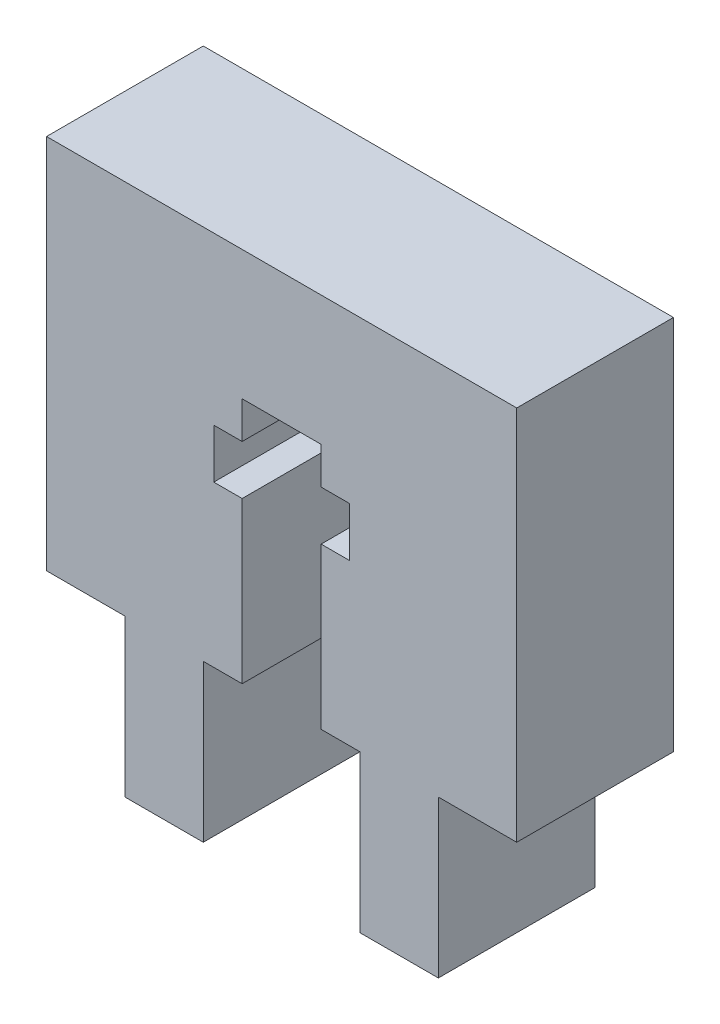
ISO-10303-21;
HEADER;
FILE_DESCRIPTION(('STEP AP214'),'2;1');
FILE_NAME('part.step','',(''),(''),'','','');
FILE_SCHEMA(('AUTOMOTIVE_DESIGN { 1 0 10303 214 1 1 1 1 }'));
ENDSEC;
DATA;
#1=APPLICATION_CONTEXT('core data for automotive mechanical design processes');
#2=APPLICATION_PROTOCOL_DEFINITION('international standard','automotive_design',2000,#1);
#3=PRODUCT_CONTEXT('',#1,'mechanical');
#4=PRODUCT('Part','Part','',(#3));
#5=PRODUCT_RELATED_PRODUCT_CATEGORY('part','',(#4));
#6=PRODUCT_DEFINITION_FORMATION('','',#4);
#7=PRODUCT_DEFINITION_CONTEXT('part definition',#1,'design');
#8=PRODUCT_DEFINITION('design','',#6,#7);
#9=PRODUCT_DEFINITION_SHAPE('','',#8);
#10=(LENGTH_UNIT() NAMED_UNIT(*) SI_UNIT(.MILLI.,.METRE.));
#11=(NAMED_UNIT(*) PLANE_ANGLE_UNIT() SI_UNIT($,.RADIAN.));
#12=(NAMED_UNIT(*) SI_UNIT($,.STERADIAN.) SOLID_ANGLE_UNIT());
#13=UNCERTAINTY_MEASURE_WITH_UNIT(LENGTH_MEASURE(1.E-05),#10,'distance_accuracy_value','');
#14=(GEOMETRIC_REPRESENTATION_CONTEXT(3) GLOBAL_UNCERTAINTY_ASSIGNED_CONTEXT((#13)) GLOBAL_UNIT_ASSIGNED_CONTEXT((#10,
#11,#12)) REPRESENTATION_CONTEXT('',''));
#15=CARTESIAN_POINT('',(0.,0.,0.));
#16=DIRECTION('',(0.,0.,1.));
#17=DIRECTION('',(1.,0.,0.));
#18=AXIS2_PLACEMENT_3D('',#15,#16,#17);
#19=CARTESIAN_POINT('',(3.175,0.,6.35));
#20=DIRECTION('',(0.,1.,0.));
#21=DIRECTION('',(-1.,0.,0.));
#22=AXIS2_PLACEMENT_3D('',#19,#20,#21);
#23=PLANE('',#22);
#24=DIRECTION('',(1.,0.,0.));
#25=VECTOR('',#24,1.);
#26=CARTESIAN_POINT('',(3.175,0.,0.));
#27=LINE('',#26,#25);
#28=CARTESIAN_POINT('',(3.175,0.,0.));
#29=VERTEX_POINT('',#28);
#30=CARTESIAN_POINT('',(4.75,0.,0.));
#31=VERTEX_POINT('',#30);
#32=EDGE_CURVE('E180',#29,#31,#27,.T.);
#33=ORIENTED_EDGE('',*,*,#32,.T.);
#34=DIRECTION('',(0.,0.,1.));
#35=VECTOR('',#34,1.);
#36=CARTESIAN_POINT('',(4.75,0.,0.));
#37=LINE('',#36,#35);
#38=CARTESIAN_POINT('',(4.75,0.,6.35));
#39=VERTEX_POINT('',#38);
#40=EDGE_CURVE('E242',#31,#39,#37,.T.);
#41=ORIENTED_EDGE('',*,*,#40,.T.);
#42=DIRECTION('',(1.,0.,0.));
#43=VECTOR('',#42,1.);
#44=CARTESIAN_POINT('',(3.175,0.,6.35));
#45=LINE('',#44,#43);
#46=CARTESIAN_POINT('',(3.175,0.,6.35));
#47=VERTEX_POINT('',#46);
#48=EDGE_CURVE('E239',#47,#39,#45,.T.);
#49=ORIENTED_EDGE('',*,*,#48,.F.);
#50=DIRECTION('',(0.,0.,-1.));
#51=VECTOR('',#50,1.);
#52=CARTESIAN_POINT('',(3.175,0.,6.35));
#53=LINE('',#52,#51);
#54=EDGE_CURVE('E211',#47,#29,#53,.T.);
#55=ORIENTED_EDGE('',*,*,#54,.T.);
#56=EDGE_LOOP('',(#33,#41,#49,#55));
#57=FACE_BOUND('',#56,.T.);
#58=ADVANCED_FACE('F35',(#57),#23,.F.);
#59=CARTESIAN_POINT('',(0.,0.,6.35));
#60=DIRECTION('',(0.,1.,0.));
#61=DIRECTION('',(-1.,0.,0.));
#62=AXIS2_PLACEMENT_3D('',#59,#60,#61);
#63=PLANE('',#62);
#64=DIRECTION('',(1.,0.,0.));
#65=VECTOR('',#64,1.);
#66=CARTESIAN_POINT('',(0.,0.,0.));
#67=LINE('',#66,#65);
#68=CARTESIAN_POINT('',(-3.175,0.,0.));
#69=VERTEX_POINT('',#68);
#70=CARTESIAN_POINT('',(0.,0.,0.));
#71=VERTEX_POINT('',#70);
#72=EDGE_CURVE('E169',#69,#71,#67,.T.);
#73=ORIENTED_EDGE('',*,*,#72,.T.);
#74=DIRECTION('',(0.,0.,-1.));
#75=VECTOR('',#74,1.);
#76=CARTESIAN_POINT('',(0.,0.,6.35));
#77=LINE('',#76,#75);
#78=CARTESIAN_POINT('',(0.,0.,6.35));
#79=VERTEX_POINT('',#78);
#80=EDGE_CURVE('E11',#79,#71,#77,.T.);
#81=ORIENTED_EDGE('',*,*,#80,.F.);
#82=DIRECTION('',(1.,0.,0.));
#83=VECTOR('',#82,1.);
#84=CARTESIAN_POINT('',(0.,0.,6.35));
#85=LINE('',#84,#83);
#86=CARTESIAN_POINT('',(-3.175,0.,6.35));
#87=VERTEX_POINT('',#86);
#88=EDGE_CURVE('E195',#87,#79,#85,.T.);
#89=ORIENTED_EDGE('',*,*,#88,.F.);
#90=DIRECTION('',(0.,0.,-1.));
#91=VECTOR('',#90,1.);
#92=CARTESIAN_POINT('',(-3.175,0.,6.35));
#93=LINE('',#92,#91);
#94=EDGE_CURVE('E165',#87,#69,#93,.T.);
#95=ORIENTED_EDGE('',*,*,#94,.T.);
#96=EDGE_LOOP('',(#73,#81,#89,#95));
#97=FACE_BOUND('',#96,.T.);
#98=ADVANCED_FACE('F37',(#97),#63,.F.);
#99=CARTESIAN_POINT('',(0.,0.,6.35));
#100=DIRECTION('',(1.,0.,0.));
#101=DIRECTION('',(0.,1.,0.));
#102=AXIS2_PLACEMENT_3D('',#99,#100,#101);
#103=PLANE('',#102);
#104=DIRECTION('',(0.,-1.,0.));
#105=VECTOR('',#104,1.);
#106=CARTESIAN_POINT('',(0.,0.,0.));
#107=LINE('',#106,#105);
#108=CARTESIAN_POINT('',(0.,-6.35,0.));
#109=VERTEX_POINT('',#108);
#110=EDGE_CURVE('E172',#71,#109,#107,.T.);
#111=ORIENTED_EDGE('',*,*,#110,.T.);
#112=DIRECTION('',(0.,0.,-1.));
#113=VECTOR('',#112,1.);
#114=CARTESIAN_POINT('',(0.,-6.35,6.35));
#115=LINE('',#114,#113);
#116=CARTESIAN_POINT('',(0.,-6.35,6.35));
#117=VERTEX_POINT('',#116);
#118=EDGE_CURVE('E43',#117,#109,#115,.T.);
#119=ORIENTED_EDGE('',*,*,#118,.F.);
#120=DIRECTION('',(0.,-1.,0.));
#121=VECTOR('',#120,1.);
#122=CARTESIAN_POINT('',(0.,0.,6.35));
#123=LINE('',#122,#121);
#124=EDGE_CURVE('E112',#79,#117,#123,.T.);
#125=ORIENTED_EDGE('',*,*,#124,.F.);
#126=ORIENTED_EDGE('',*,*,#80,.T.);
#127=EDGE_LOOP('',(#111,#119,#125,#126));
#128=FACE_BOUND('',#127,.T.);
#129=ADVANCED_FACE('F474',(#128),#103,.F.);
#130=CARTESIAN_POINT('',(0.,-6.35,6.35));
#131=DIRECTION('',(0.,1.,0.));
#132=DIRECTION('',(0.,0.,1.));
#133=AXIS2_PLACEMENT_3D('',#130,#131,#132);
#134=PLANE('',#133);
#135=DIRECTION('',(1.,0.,0.));
#136=VECTOR('',#135,1.);
#137=CARTESIAN_POINT('',(0.,-6.35,0.));
#138=LINE('',#137,#136);
#139=CARTESIAN_POINT('',(3.175,-6.35,0.));
#140=VERTEX_POINT('',#139);
#141=EDGE_CURVE('E175',#109,#140,#138,.T.);
#142=ORIENTED_EDGE('',*,*,#141,.T.);
#143=DIRECTION('',(0.,0.,-1.));
#144=VECTOR('',#143,1.);
#145=CARTESIAN_POINT('',(3.175,-6.35,6.35));
#146=LINE('',#145,#144);
#147=CARTESIAN_POINT('',(3.175,-6.35,6.35));
#148=VERTEX_POINT('',#147);
#149=EDGE_CURVE('E214',#148,#140,#146,.T.);
#150=ORIENTED_EDGE('',*,*,#149,.F.);
#151=DIRECTION('',(1.,0.,0.));
#152=VECTOR('',#151,1.);
#153=CARTESIAN_POINT('',(0.,-6.35,6.35));
#154=LINE('',#153,#152);
#155=EDGE_CURVE('E222',#117,#148,#154,.T.);
#156=ORIENTED_EDGE('',*,*,#155,.F.);
#157=ORIENTED_EDGE('',*,*,#118,.T.);
#158=EDGE_LOOP('',(#142,#150,#156,#157));
#159=FACE_BOUND('',#158,.T.);
#160=ADVANCED_FACE('F220',(#159),#134,.F.);
#161=CARTESIAN_POINT('',(3.175,0.,6.35));
#162=DIRECTION('',(-1.,0.,0.));
#163=DIRECTION('',(0.,-1.,0.));
#164=AXIS2_PLACEMENT_3D('',#161,#162,#163);
#165=PLANE('',#164);
#166=DIRECTION('',(0.,1.,0.));
#167=VECTOR('',#166,1.);
#168=CARTESIAN_POINT('',(3.175,0.,0.));
#169=LINE('',#168,#167);
#170=EDGE_CURVE('E177',#140,#29,#169,.T.);
#171=ORIENTED_EDGE('',*,*,#170,.T.);
#172=ORIENTED_EDGE('',*,*,#54,.F.);
#173=DIRECTION('',(0.,1.,0.));
#174=VECTOR('',#173,1.);
#175=CARTESIAN_POINT('',(3.175,0.,6.35));
#176=LINE('',#175,#174);
#177=EDGE_CURVE('E248',#148,#47,#176,.T.);
#178=ORIENTED_EDGE('',*,*,#177,.F.);
#179=ORIENTED_EDGE('',*,*,#149,.T.);
#180=EDGE_LOOP('',(#171,#172,#178,#179));
#181=FACE_BOUND('',#180,.T.);
#182=ADVANCED_FACE('F232',(#181),#165,.F.);
#183=CARTESIAN_POINT('',(7.95,0.,6.35));
#184=VERTEX_POINT('',#183);
#185=CARTESIAN_POINT('',(9.525,0.,6.35));
#186=VERTEX_POINT('',#185);
#187=EDGE_CURVE('E244',#184,#186,#45,.T.);
#188=ORIENTED_EDGE('',*,*,#187,.F.);
#189=DIRECTION('',(0.,0.,1.));
#190=VECTOR('',#189,1.);
#191=CARTESIAN_POINT('',(7.95,0.,0.));
#192=LINE('',#191,#190);
#193=CARTESIAN_POINT('',(7.95,0.,0.));
#194=VERTEX_POINT('',#193);
#195=EDGE_CURVE('E272',#194,#184,#192,.T.);
#196=ORIENTED_EDGE('',*,*,#195,.F.);
#197=CARTESIAN_POINT('',(9.525,0.,0.));
#198=VERTEX_POINT('',#197);
#199=EDGE_CURVE('E179',#194,#198,#27,.T.);
#200=ORIENTED_EDGE('',*,*,#199,.T.);
#201=DIRECTION('',(0.,0.,-1.));
#202=VECTOR('',#201,1.);
#203=CARTESIAN_POINT('',(9.525,0.,6.35));
#204=LINE('',#203,#202);
#205=EDGE_CURVE('E208',#186,#198,#204,.T.);
#206=ORIENTED_EDGE('',*,*,#205,.F.);
#207=EDGE_LOOP('',(#188,#196,#200,#206));
#208=FACE_BOUND('',#207,.T.);
#209=ADVANCED_FACE('F450',(#208),#23,.F.);
#210=CARTESIAN_POINT('',(9.525,0.,6.35));
#211=DIRECTION('',(1.,0.,0.));
#212=DIRECTION('',(0.,1.,0.));
#213=AXIS2_PLACEMENT_3D('',#210,#211,#212);
#214=PLANE('',#213);
#215=DIRECTION('',(0.,-1.,0.));
#216=VECTOR('',#215,1.);
#217=CARTESIAN_POINT('',(9.525,0.,0.));
#218=LINE('',#217,#216);
#219=CARTESIAN_POINT('',(9.525,-6.35,0.));
#220=VERTEX_POINT('',#219);
#221=EDGE_CURVE('E183',#198,#220,#218,.T.);
#222=ORIENTED_EDGE('',*,*,#221,.T.);
#223=DIRECTION('',(0.,0.,-1.));
#224=VECTOR('',#223,1.);
#225=CARTESIAN_POINT('',(9.525,-6.35,6.35));
#226=LINE('',#225,#224);
#227=CARTESIAN_POINT('',(9.525,-6.35,6.35));
#228=VERTEX_POINT('',#227);
#229=EDGE_CURVE('E205',#228,#220,#226,.T.);
#230=ORIENTED_EDGE('',*,*,#229,.F.);
#231=DIRECTION('',(0.,-1.,0.));
#232=VECTOR('',#231,1.);
#233=CARTESIAN_POINT('',(9.525,0.,6.35));
#234=LINE('',#233,#232);
#235=EDGE_CURVE('E243',#186,#228,#234,.T.);
#236=ORIENTED_EDGE('',*,*,#235,.F.);
#237=ORIENTED_EDGE('',*,*,#205,.T.);
#238=EDGE_LOOP('',(#222,#230,#236,#237));
#239=FACE_BOUND('',#238,.T.);
#240=ADVANCED_FACE('F457',(#239),#214,.F.);
#241=CARTESIAN_POINT('',(12.7,-6.35,6.35));
#242=DIRECTION('',(0.,1.,0.));
#243=DIRECTION('',(-1.,0.,0.));
#244=AXIS2_PLACEMENT_3D('',#241,#242,#243);
#245=PLANE('',#244);
#246=DIRECTION('',(1.,0.,0.));
#247=VECTOR('',#246,1.);
#248=CARTESIAN_POINT('',(12.7,-6.35,0.));
#249=LINE('',#248,#247);
#250=CARTESIAN_POINT('',(12.7,-6.35,0.));
#251=VERTEX_POINT('',#250);
#252=EDGE_CURVE('E185',#220,#251,#249,.T.);
#253=ORIENTED_EDGE('',*,*,#252,.T.);
#254=DIRECTION('',(0.,0.,-1.));
#255=VECTOR('',#254,1.);
#256=CARTESIAN_POINT('',(12.7,-6.35,6.35));
#257=LINE('',#256,#255);
#258=CARTESIAN_POINT('',(12.7,-6.35,6.35));
#259=VERTEX_POINT('',#258);
#260=EDGE_CURVE('E202',#259,#251,#257,.T.);
#261=ORIENTED_EDGE('',*,*,#260,.F.);
#262=DIRECTION('',(1.,0.,0.));
#263=VECTOR('',#262,1.);
#264=CARTESIAN_POINT('',(12.7,-6.35,6.35));
#265=LINE('',#264,#263);
#266=EDGE_CURVE('E246',#228,#259,#265,.T.);
#267=ORIENTED_EDGE('',*,*,#266,.F.);
#268=ORIENTED_EDGE('',*,*,#229,.T.);
#269=EDGE_LOOP('',(#253,#261,#267,#268));
#270=FACE_BOUND('',#269,.T.);
#271=ADVANCED_FACE('F460',(#270),#245,.F.);
#272=CARTESIAN_POINT('',(12.7,0.,6.35));
#273=DIRECTION('',(-1.,0.,0.));
#274=DIRECTION('',(0.,0.,1.));
#275=AXIS2_PLACEMENT_3D('',#272,#273,#274);
#276=PLANE('',#275);
#277=DIRECTION('',(0.,1.,0.));
#278=VECTOR('',#277,1.);
#279=CARTESIAN_POINT('',(12.7,0.,0.));
#280=LINE('',#279,#278);
#281=CARTESIAN_POINT('',(12.7,0.,0.));
#282=VERTEX_POINT('',#281);
#283=EDGE_CURVE('E187',#251,#282,#280,.T.);
#284=ORIENTED_EDGE('',*,*,#283,.T.);
#285=DIRECTION('',(0.,0.,-1.));
#286=VECTOR('',#285,1.);
#287=CARTESIAN_POINT('',(12.7,0.,6.35));
#288=LINE('',#287,#286);
#289=CARTESIAN_POINT('',(12.7,0.,6.35));
#290=VERTEX_POINT('',#289);
#291=EDGE_CURVE('E199',#290,#282,#288,.T.);
#292=ORIENTED_EDGE('',*,*,#291,.F.);
#293=DIRECTION('',(0.,1.,0.));
#294=VECTOR('',#293,1.);
#295=CARTESIAN_POINT('',(12.7,0.,6.35));
#296=LINE('',#295,#294);
#297=EDGE_CURVE('E253',#259,#290,#296,.T.);
#298=ORIENTED_EDGE('',*,*,#297,.F.);
#299=ORIENTED_EDGE('',*,*,#260,.T.);
#300=EDGE_LOOP('',(#284,#292,#298,#299));
#301=FACE_BOUND('',#300,.T.);
#302=ADVANCED_FACE('F259',(#301),#276,.F.);
#303=CARTESIAN_POINT('',(12.7,0.,6.35));
#304=DIRECTION('',(0.,1.,0.));
#305=DIRECTION('',(-1.,0.,0.));
#306=AXIS2_PLACEMENT_3D('',#303,#304,#305);
#307=PLANE('',#306);
#308=DIRECTION('',(1.,0.,0.));
#309=VECTOR('',#308,1.);
#310=CARTESIAN_POINT('',(12.7,0.,0.));
#311=LINE('',#310,#309);
#312=CARTESIAN_POINT('',(15.875,0.,0.));
#313=VERTEX_POINT('',#312);
#314=EDGE_CURVE('E189',#282,#313,#311,.T.);
#315=ORIENTED_EDGE('',*,*,#314,.T.);
#316=DIRECTION('',(0.,0.,-1.));
#317=VECTOR('',#316,1.);
#318=CARTESIAN_POINT('',(15.875,0.,6.35));
#319=LINE('',#318,#317);
#320=CARTESIAN_POINT('',(15.875,0.,6.35));
#321=VERTEX_POINT('',#320);
#322=EDGE_CURVE('E160',#321,#313,#319,.T.);
#323=ORIENTED_EDGE('',*,*,#322,.F.);
#324=DIRECTION('',(1.,0.,0.));
#325=VECTOR('',#324,1.);
#326=CARTESIAN_POINT('',(12.7,0.,6.35));
#327=LINE('',#326,#325);
#328=EDGE_CURVE('E148',#290,#321,#327,.T.);
#329=ORIENTED_EDGE('',*,*,#328,.F.);
#330=ORIENTED_EDGE('',*,*,#291,.T.);
#331=EDGE_LOOP('',(#315,#323,#329,#330));
#332=FACE_BOUND('',#331,.T.);
#333=ADVANCED_FACE('F263',(#332),#307,.F.);
#334=CARTESIAN_POINT('',(15.875,15.24,6.35));
#335=DIRECTION('',(-1.,0.,0.));
#336=DIRECTION('',(0.,0.,1.));
#337=AXIS2_PLACEMENT_3D('',#334,#335,#336);
#338=PLANE('',#337);
#339=DIRECTION('',(0.,1.,0.));
#340=VECTOR('',#339,1.);
#341=CARTESIAN_POINT('',(15.875,15.24,0.));
#342=LINE('',#341,#340);
#343=CARTESIAN_POINT('',(15.875,15.24,0.));
#344=VERTEX_POINT('',#343);
#345=EDGE_CURVE('E157',#313,#344,#342,.T.);
#346=ORIENTED_EDGE('',*,*,#345,.T.);
#347=DIRECTION('',(0.,0.,-1.));
#348=VECTOR('',#347,1.);
#349=CARTESIAN_POINT('',(15.875,15.24,6.35));
#350=LINE('',#349,#348);
#351=CARTESIAN_POINT('',(15.875,15.24,6.35));
#352=VERTEX_POINT('',#351);
#353=EDGE_CURVE('E154',#352,#344,#350,.T.);
#354=ORIENTED_EDGE('',*,*,#353,.F.);
#355=DIRECTION('',(0.,1.,0.));
#356=VECTOR('',#355,1.);
#357=CARTESIAN_POINT('',(15.875,15.24,6.35));
#358=LINE('',#357,#356);
#359=EDGE_CURVE('E140',#321,#352,#358,.T.);
#360=ORIENTED_EDGE('',*,*,#359,.F.);
#361=ORIENTED_EDGE('',*,*,#322,.T.);
#362=EDGE_LOOP('',(#346,#354,#360,#361));
#363=FACE_BOUND('',#362,.T.);
#364=ADVANCED_FACE('F155',(#363),#338,.F.);
#365=CARTESIAN_POINT('',(-3.175,15.24,6.35));
#366=DIRECTION('',(0.,-1.,0.));
#367=DIRECTION('',(0.,0.,-1.));
#368=AXIS2_PLACEMENT_3D('',#365,#366,#367);
#369=PLANE('',#368);
#370=DIRECTION('',(-1.,0.,0.));
#371=VECTOR('',#370,1.);
#372=CARTESIAN_POINT('',(-3.175,15.24,0.));
#373=LINE('',#372,#371);
#374=CARTESIAN_POINT('',(-3.175,15.24,0.));
#375=VERTEX_POINT('',#374);
#376=EDGE_CURVE('E192',#344,#375,#373,.T.);
#377=ORIENTED_EDGE('',*,*,#376,.T.);
#378=DIRECTION('',(0.,0.,-1.));
#379=VECTOR('',#378,1.);
#380=CARTESIAN_POINT('',(-3.175,15.24,6.35));
#381=LINE('',#380,#379);
#382=CARTESIAN_POINT('',(-3.175,15.24,6.35));
#383=VERTEX_POINT('',#382);
#384=EDGE_CURVE('E161',#383,#375,#381,.T.);
#385=ORIENTED_EDGE('',*,*,#384,.F.);
#386=DIRECTION('',(-1.,0.,0.));
#387=VECTOR('',#386,1.);
#388=CARTESIAN_POINT('',(-3.175,15.24,6.35));
#389=LINE('',#388,#387);
#390=EDGE_CURVE('E145',#352,#383,#389,.T.);
#391=ORIENTED_EDGE('',*,*,#390,.F.);
#392=ORIENTED_EDGE('',*,*,#353,.T.);
#393=EDGE_LOOP('',(#377,#385,#391,#392));
#394=FACE_BOUND('',#393,.T.);
#395=ADVANCED_FACE('F163',(#394),#369,.F.);
#396=CARTESIAN_POINT('',(-3.175,15.24,6.35));
#397=DIRECTION('',(1.,0.,0.));
#398=DIRECTION('',(0.,1.,0.));
#399=AXIS2_PLACEMENT_3D('',#396,#397,#398);
#400=PLANE('',#399);
#401=DIRECTION('',(0.,-1.,0.));
#402=VECTOR('',#401,1.);
#403=CARTESIAN_POINT('',(-3.175,15.24,0.));
#404=LINE('',#403,#402);
#405=EDGE_CURVE('E104',#375,#69,#404,.T.);
#406=ORIENTED_EDGE('',*,*,#405,.T.);
#407=ORIENTED_EDGE('',*,*,#94,.F.);
#408=DIRECTION('',(0.,-1.,0.));
#409=VECTOR('',#408,1.);
#410=CARTESIAN_POINT('',(-3.175,15.24,6.35));
#411=LINE('',#410,#409);
#412=EDGE_CURVE('E59',#383,#87,#411,.T.);
#413=ORIENTED_EDGE('',*,*,#412,.F.);
#414=ORIENTED_EDGE('',*,*,#384,.T.);
#415=EDGE_LOOP('',(#406,#407,#413,#414));
#416=FACE_BOUND('',#415,.T.);
#417=ADVANCED_FACE('F264',(#416),#400,.F.);
#418=CARTESIAN_POINT('',(0.,0.,6.35));
#419=DIRECTION('',(0.,0.,1.));
#420=DIRECTION('',(1.,0.,0.));
#421=AXIS2_PLACEMENT_3D('',#418,#419,#420);
#422=PLANE('',#421);
#423=DIRECTION('',(0.,-1.,0.));
#424=VECTOR('',#423,1.);
#425=CARTESIAN_POINT('',(4.75,0.,6.35));
#426=LINE('',#425,#424);
#427=CARTESIAN_POINT('',(4.75,6.5,6.35));
#428=VERTEX_POINT('',#427);
#429=EDGE_CURVE('E335',#428,#39,#426,.T.);
#430=ORIENTED_EDGE('',*,*,#429,.F.);
#431=DIRECTION('',(1.,0.,0.));
#432=VECTOR('',#431,1.);
#433=CARTESIAN_POINT('',(4.75,6.5,6.35));
#434=LINE('',#433,#432);
#435=CARTESIAN_POINT('',(3.6,6.5,6.35));
#436=VERTEX_POINT('',#435);
#437=EDGE_CURVE('E304',#436,#428,#434,.T.);
#438=ORIENTED_EDGE('',*,*,#437,.F.);
#439=DIRECTION('',(0.,-1.,0.));
#440=VECTOR('',#439,1.);
#441=CARTESIAN_POINT('',(3.6,8.5,6.35));
#442=LINE('',#441,#440);
#443=CARTESIAN_POINT('',(3.6,8.5,6.35));
#444=VERTEX_POINT('',#443);
#445=EDGE_CURVE('E308',#444,#436,#442,.T.);
#446=ORIENTED_EDGE('',*,*,#445,.F.);
#447=DIRECTION('',(-1.,0.,0.));
#448=VECTOR('',#447,1.);
#449=CARTESIAN_POINT('',(4.75,8.5,6.35));
#450=LINE('',#449,#448);
#451=CARTESIAN_POINT('',(4.75,8.5,6.35));
#452=VERTEX_POINT('',#451);
#453=EDGE_CURVE('E311',#452,#444,#450,.T.);
#454=ORIENTED_EDGE('',*,*,#453,.F.);
#455=DIRECTION('',(0.,-1.,0.));
#456=VECTOR('',#455,1.);
#457=CARTESIAN_POINT('',(4.75,8.5,6.35));
#458=LINE('',#457,#456);
#459=CARTESIAN_POINT('',(4.75,10.,6.35));
#460=VERTEX_POINT('',#459);
#461=EDGE_CURVE('E314',#460,#452,#458,.T.);
#462=ORIENTED_EDGE('',*,*,#461,.F.);
#463=DIRECTION('',(-1.,0.,0.));
#464=VECTOR('',#463,1.);
#465=CARTESIAN_POINT('',(4.75,10.,6.35));
#466=LINE('',#465,#464);
#467=CARTESIAN_POINT('',(7.95,10.,6.35));
#468=VERTEX_POINT('',#467);
#469=EDGE_CURVE('E317',#468,#460,#466,.T.);
#470=ORIENTED_EDGE('',*,*,#469,.F.);
#471=DIRECTION('',(0.,1.,0.));
#472=VECTOR('',#471,1.);
#473=CARTESIAN_POINT('',(7.95,8.5,6.35));
#474=LINE('',#473,#472);
#475=CARTESIAN_POINT('',(7.95,8.5,6.35));
#476=VERTEX_POINT('',#475);
#477=EDGE_CURVE('E320',#476,#468,#474,.T.);
#478=ORIENTED_EDGE('',*,*,#477,.F.);
#479=DIRECTION('',(-1.,0.,0.));
#480=VECTOR('',#479,1.);
#481=CARTESIAN_POINT('',(7.95,8.5,6.35));
#482=LINE('',#481,#480);
#483=CARTESIAN_POINT('',(9.1,8.5,6.35));
#484=VERTEX_POINT('',#483);
#485=EDGE_CURVE('E323',#484,#476,#482,.T.);
#486=ORIENTED_EDGE('',*,*,#485,.F.);
#487=DIRECTION('',(0.,1.,0.));
#488=VECTOR('',#487,1.);
#489=CARTESIAN_POINT('',(9.1,8.5,6.35));
#490=LINE('',#489,#488);
#491=CARTESIAN_POINT('',(9.1,6.5,6.35));
#492=VERTEX_POINT('',#491);
#493=EDGE_CURVE('E326',#492,#484,#490,.T.);
#494=ORIENTED_EDGE('',*,*,#493,.F.);
#495=DIRECTION('',(1.,0.,0.));
#496=VECTOR('',#495,1.);
#497=CARTESIAN_POINT('',(7.95,6.5,6.35));
#498=LINE('',#497,#496);
#499=CARTESIAN_POINT('',(7.95,6.5,6.35));
#500=VERTEX_POINT('',#499);
#501=EDGE_CURVE('E329',#500,#492,#498,.T.);
#502=ORIENTED_EDGE('',*,*,#501,.F.);
#503=DIRECTION('',(0.,1.,0.));
#504=VECTOR('',#503,1.);
#505=CARTESIAN_POINT('',(7.95,0.,6.35));
#506=LINE('',#505,#504);
#507=EDGE_CURVE('E332',#184,#500,#506,.T.);
#508=ORIENTED_EDGE('',*,*,#507,.F.);
#509=ORIENTED_EDGE('',*,*,#187,.T.);
#510=ORIENTED_EDGE('',*,*,#235,.T.);
#511=ORIENTED_EDGE('',*,*,#266,.T.);
#512=ORIENTED_EDGE('',*,*,#297,.T.);
#513=ORIENTED_EDGE('',*,*,#328,.T.);
#514=ORIENTED_EDGE('',*,*,#359,.T.);
#515=ORIENTED_EDGE('',*,*,#390,.T.);
#516=ORIENTED_EDGE('',*,*,#412,.T.);
#517=ORIENTED_EDGE('',*,*,#88,.T.);
#518=ORIENTED_EDGE('',*,*,#124,.T.);
#519=ORIENTED_EDGE('',*,*,#155,.T.);
#520=ORIENTED_EDGE('',*,*,#177,.T.);
#521=ORIENTED_EDGE('',*,*,#48,.T.);
#522=EDGE_LOOP('',(#430,#438,#446,#454,#462,#470,#478,#486,#494,#502,#508,#509,#510,#511,#512,
#513,#514,#515,#516,#517,#518,#519,#520,#521));
#523=FACE_BOUND('',#522,.T.);
#524=ADVANCED_FACE('F143',(#523),#422,.T.);
#525=CARTESIAN_POINT('',(0.,0.,0.));
#526=DIRECTION('',(0.,0.,1.));
#527=DIRECTION('',(1.,0.,0.));
#528=AXIS2_PLACEMENT_3D('',#525,#526,#527);
#529=PLANE('',#528);
#530=DIRECTION('',(1.,0.,0.));
#531=VECTOR('',#530,1.);
#532=CARTESIAN_POINT('',(4.75,6.5,0.));
#533=LINE('',#532,#531);
#534=CARTESIAN_POINT('',(3.6,6.5,0.));
#535=VERTEX_POINT('',#534);
#536=CARTESIAN_POINT('',(4.75,6.5,0.));
#537=VERTEX_POINT('',#536);
#538=EDGE_CURVE('E273',#535,#537,#533,.T.);
#539=ORIENTED_EDGE('',*,*,#538,.T.);
#540=DIRECTION('',(0.,-1.,0.));
#541=VECTOR('',#540,1.);
#542=CARTESIAN_POINT('',(4.75,0.,0.));
#543=LINE('',#542,#541);
#544=EDGE_CURVE('E307',#537,#31,#543,.T.);
#545=ORIENTED_EDGE('',*,*,#544,.T.);
#546=ORIENTED_EDGE('',*,*,#32,.F.);
#547=ORIENTED_EDGE('',*,*,#170,.F.);
#548=ORIENTED_EDGE('',*,*,#141,.F.);
#549=ORIENTED_EDGE('',*,*,#110,.F.);
#550=ORIENTED_EDGE('',*,*,#72,.F.);
#551=ORIENTED_EDGE('',*,*,#405,.F.);
#552=ORIENTED_EDGE('',*,*,#376,.F.);
#553=ORIENTED_EDGE('',*,*,#345,.F.);
#554=ORIENTED_EDGE('',*,*,#314,.F.);
#555=ORIENTED_EDGE('',*,*,#283,.F.);
#556=ORIENTED_EDGE('',*,*,#252,.F.);
#557=ORIENTED_EDGE('',*,*,#221,.F.);
#558=ORIENTED_EDGE('',*,*,#199,.F.);
#559=DIRECTION('',(0.,1.,0.));
#560=VECTOR('',#559,1.);
#561=CARTESIAN_POINT('',(7.95,0.,0.));
#562=LINE('',#561,#560);
#563=CARTESIAN_POINT('',(7.95,6.5,0.));
#564=VERTEX_POINT('',#563);
#565=EDGE_CURVE('E361',#194,#564,#562,.T.);
#566=ORIENTED_EDGE('',*,*,#565,.T.);
#567=DIRECTION('',(1.,0.,0.));
#568=VECTOR('',#567,1.);
#569=CARTESIAN_POINT('',(7.95,6.5,0.));
#570=LINE('',#569,#568);
#571=CARTESIAN_POINT('',(9.1,6.5,0.));
#572=VERTEX_POINT('',#571);
#573=EDGE_CURVE('E50',#564,#572,#570,.T.);
#574=ORIENTED_EDGE('',*,*,#573,.T.);
#575=DIRECTION('',(0.,1.,0.));
#576=VECTOR('',#575,1.);
#577=CARTESIAN_POINT('',(9.1,8.5,0.));
#578=LINE('',#577,#576);
#579=CARTESIAN_POINT('',(9.1,8.5,0.));
#580=VERTEX_POINT('',#579);
#581=EDGE_CURVE('E357',#572,#580,#578,.T.);
#582=ORIENTED_EDGE('',*,*,#581,.T.);
#583=DIRECTION('',(-1.,0.,0.));
#584=VECTOR('',#583,1.);
#585=CARTESIAN_POINT('',(7.95,8.5,0.));
#586=LINE('',#585,#584);
#587=CARTESIAN_POINT('',(7.95,8.5,0.));
#588=VERTEX_POINT('',#587);
#589=EDGE_CURVE('E354',#580,#588,#586,.T.);
#590=ORIENTED_EDGE('',*,*,#589,.T.);
#591=DIRECTION('',(0.,1.,0.));
#592=VECTOR('',#591,1.);
#593=CARTESIAN_POINT('',(7.95,8.5,0.));
#594=LINE('',#593,#592);
#595=CARTESIAN_POINT('',(7.95,10.,0.));
#596=VERTEX_POINT('',#595);
#597=EDGE_CURVE('E351',#588,#596,#594,.T.);
#598=ORIENTED_EDGE('',*,*,#597,.T.);
#599=DIRECTION('',(-1.,0.,0.));
#600=VECTOR('',#599,1.);
#601=CARTESIAN_POINT('',(4.75,10.,0.));
#602=LINE('',#601,#600);
#603=CARTESIAN_POINT('',(4.75,10.,0.));
#604=VERTEX_POINT('',#603);
#605=EDGE_CURVE('E348',#596,#604,#602,.T.);
#606=ORIENTED_EDGE('',*,*,#605,.T.);
#607=DIRECTION('',(0.,-1.,0.));
#608=VECTOR('',#607,1.);
#609=CARTESIAN_POINT('',(4.75,8.5,0.));
#610=LINE('',#609,#608);
#611=CARTESIAN_POINT('',(4.75,8.5,0.));
#612=VERTEX_POINT('',#611);
#613=EDGE_CURVE('E345',#604,#612,#610,.T.);
#614=ORIENTED_EDGE('',*,*,#613,.T.);
#615=DIRECTION('',(-1.,0.,0.));
#616=VECTOR('',#615,1.);
#617=CARTESIAN_POINT('',(4.75,8.5,0.));
#618=LINE('',#617,#616);
#619=CARTESIAN_POINT('',(3.6,8.5,0.));
#620=VERTEX_POINT('',#619);
#621=EDGE_CURVE('E342',#612,#620,#618,.T.);
#622=ORIENTED_EDGE('',*,*,#621,.T.);
#623=DIRECTION('',(0.,-1.,0.));
#624=VECTOR('',#623,1.);
#625=CARTESIAN_POINT('',(3.6,8.5,0.));
#626=LINE('',#625,#624);
#627=EDGE_CURVE('E339',#620,#535,#626,.T.);
#628=ORIENTED_EDGE('',*,*,#627,.T.);
#629=EDGE_LOOP('',(#539,#545,#546,#547,#548,#549,#550,#551,#552,#553,#554,#555,#556,#557,#558,
#566,#574,#582,#590,#598,#606,#614,#622,#628));
#630=FACE_BOUND('',#629,.T.);
#631=ADVANCED_FACE('F226',(#630),#529,.F.);
#632=CARTESIAN_POINT('',(4.75,0.,0.));
#633=DIRECTION('',(-1.,0.,0.));
#634=DIRECTION('',(0.,-1.,0.));
#635=AXIS2_PLACEMENT_3D('',#632,#633,#634);
#636=PLANE('',#635);
#637=ORIENTED_EDGE('',*,*,#429,.T.);
#638=ORIENTED_EDGE('',*,*,#40,.F.);
#639=ORIENTED_EDGE('',*,*,#544,.F.);
#640=DIRECTION('',(0.,0.,1.));
#641=VECTOR('',#640,1.);
#642=CARTESIAN_POINT('',(4.75,6.5,0.));
#643=LINE('',#642,#641);
#644=EDGE_CURVE('E173',#537,#428,#643,.T.);
#645=ORIENTED_EDGE('',*,*,#644,.T.);
#646=EDGE_LOOP('',(#637,#638,#639,#645));
#647=FACE_BOUND('',#646,.T.);
#648=ADVANCED_FACE('F369',(#647),#636,.F.);
#649=CARTESIAN_POINT('',(4.75,6.5,0.));
#650=DIRECTION('',(0.,-1.,0.));
#651=DIRECTION('',(1.,0.,0.));
#652=AXIS2_PLACEMENT_3D('',#649,#650,#651);
#653=PLANE('',#652);
#654=ORIENTED_EDGE('',*,*,#437,.T.);
#655=ORIENTED_EDGE('',*,*,#644,.F.);
#656=ORIENTED_EDGE('',*,*,#538,.F.);
#657=DIRECTION('',(0.,0.,1.));
#658=VECTOR('',#657,1.);
#659=CARTESIAN_POINT('',(3.6,6.5,0.));
#660=LINE('',#659,#658);
#661=EDGE_CURVE('E299',#535,#436,#660,.T.);
#662=ORIENTED_EDGE('',*,*,#661,.T.);
#663=EDGE_LOOP('',(#654,#655,#656,#662));
#664=FACE_BOUND('',#663,.T.);
#665=ADVANCED_FACE('F398',(#664),#653,.F.);
#666=CARTESIAN_POINT('',(3.6,8.5,0.));
#667=DIRECTION('',(-1.,0.,0.));
#668=DIRECTION('',(0.,0.,1.));
#669=AXIS2_PLACEMENT_3D('',#666,#667,#668);
#670=PLANE('',#669);
#671=ORIENTED_EDGE('',*,*,#445,.T.);
#672=ORIENTED_EDGE('',*,*,#661,.F.);
#673=ORIENTED_EDGE('',*,*,#627,.F.);
#674=DIRECTION('',(0.,0.,1.));
#675=VECTOR('',#674,1.);
#676=CARTESIAN_POINT('',(3.6,8.5,0.));
#677=LINE('',#676,#675);
#678=EDGE_CURVE('E296',#620,#444,#677,.T.);
#679=ORIENTED_EDGE('',*,*,#678,.T.);
#680=EDGE_LOOP('',(#671,#672,#673,#679));
#681=FACE_BOUND('',#680,.T.);
#682=ADVANCED_FACE('F403',(#681),#670,.F.);
#683=CARTESIAN_POINT('',(4.75,8.5,0.));
#684=DIRECTION('',(0.,1.,0.));
#685=DIRECTION('',(-1.,0.,0.));
#686=AXIS2_PLACEMENT_3D('',#683,#684,#685);
#687=PLANE('',#686);
#688=ORIENTED_EDGE('',*,*,#453,.T.);
#689=ORIENTED_EDGE('',*,*,#678,.F.);
#690=ORIENTED_EDGE('',*,*,#621,.F.);
#691=DIRECTION('',(0.,0.,1.));
#692=VECTOR('',#691,1.);
#693=CARTESIAN_POINT('',(4.75,8.5,0.));
#694=LINE('',#693,#692);
#695=EDGE_CURVE('E293',#612,#452,#694,.T.);
#696=ORIENTED_EDGE('',*,*,#695,.T.);
#697=EDGE_LOOP('',(#688,#689,#690,#696));
#698=FACE_BOUND('',#697,.T.);
#699=ADVANCED_FACE('F409',(#698),#687,.F.);
#700=CARTESIAN_POINT('',(4.75,8.5,0.));
#701=DIRECTION('',(-1.,0.,0.));
#702=DIRECTION('',(0.,0.,1.));
#703=AXIS2_PLACEMENT_3D('',#700,#701,#702);
#704=PLANE('',#703);
#705=ORIENTED_EDGE('',*,*,#461,.T.);
#706=ORIENTED_EDGE('',*,*,#695,.F.);
#707=ORIENTED_EDGE('',*,*,#613,.F.);
#708=DIRECTION('',(0.,0.,1.));
#709=VECTOR('',#708,1.);
#710=CARTESIAN_POINT('',(4.75,10.,0.));
#711=LINE('',#710,#709);
#712=EDGE_CURVE('E290',#604,#460,#711,.T.);
#713=ORIENTED_EDGE('',*,*,#712,.T.);
#714=EDGE_LOOP('',(#705,#706,#707,#713));
#715=FACE_BOUND('',#714,.T.);
#716=ADVANCED_FACE('F415',(#715),#704,.F.);
#717=CARTESIAN_POINT('',(4.75,10.,0.));
#718=DIRECTION('',(0.,1.,0.));
#719=DIRECTION('',(0.,0.,1.));
#720=AXIS2_PLACEMENT_3D('',#717,#718,#719);
#721=PLANE('',#720);
#722=ORIENTED_EDGE('',*,*,#469,.T.);
#723=ORIENTED_EDGE('',*,*,#712,.F.);
#724=ORIENTED_EDGE('',*,*,#605,.F.);
#725=DIRECTION('',(0.,0.,1.));
#726=VECTOR('',#725,1.);
#727=CARTESIAN_POINT('',(7.95,10.,0.));
#728=LINE('',#727,#726);
#729=EDGE_CURVE('E287',#596,#468,#728,.T.);
#730=ORIENTED_EDGE('',*,*,#729,.T.);
#731=EDGE_LOOP('',(#722,#723,#724,#730));
#732=FACE_BOUND('',#731,.T.);
#733=ADVANCED_FACE('F420',(#732),#721,.F.);
#734=CARTESIAN_POINT('',(7.95,8.5,0.));
#735=DIRECTION('',(1.,0.,0.));
#736=DIRECTION('',(0.,0.,-1.));
#737=AXIS2_PLACEMENT_3D('',#734,#735,#736);
#738=PLANE('',#737);
#739=ORIENTED_EDGE('',*,*,#477,.T.);
#740=ORIENTED_EDGE('',*,*,#729,.F.);
#741=ORIENTED_EDGE('',*,*,#597,.F.);
#742=DIRECTION('',(0.,0.,1.));
#743=VECTOR('',#742,1.);
#744=CARTESIAN_POINT('',(7.95,8.5,0.));
#745=LINE('',#744,#743);
#746=EDGE_CURVE('E284',#588,#476,#745,.T.);
#747=ORIENTED_EDGE('',*,*,#746,.T.);
#748=EDGE_LOOP('',(#739,#740,#741,#747));
#749=FACE_BOUND('',#748,.T.);
#750=ADVANCED_FACE('F426',(#749),#738,.F.);
#751=CARTESIAN_POINT('',(7.95,8.5,0.));
#752=DIRECTION('',(0.,1.,0.));
#753=DIRECTION('',(-1.,0.,0.));
#754=AXIS2_PLACEMENT_3D('',#751,#752,#753);
#755=PLANE('',#754);
#756=ORIENTED_EDGE('',*,*,#485,.T.);
#757=ORIENTED_EDGE('',*,*,#746,.F.);
#758=ORIENTED_EDGE('',*,*,#589,.F.);
#759=DIRECTION('',(0.,0.,1.));
#760=VECTOR('',#759,1.);
#761=CARTESIAN_POINT('',(9.1,8.5,0.));
#762=LINE('',#761,#760);
#763=EDGE_CURVE('E281',#580,#484,#762,.T.);
#764=ORIENTED_EDGE('',*,*,#763,.T.);
#765=EDGE_LOOP('',(#756,#757,#758,#764));
#766=FACE_BOUND('',#765,.T.);
#767=ADVANCED_FACE('F433',(#766),#755,.F.);
#768=CARTESIAN_POINT('',(9.1,8.5,0.));
#769=DIRECTION('',(1.,0.,0.));
#770=DIRECTION('',(0.,0.,-1.));
#771=AXIS2_PLACEMENT_3D('',#768,#769,#770);
#772=PLANE('',#771);
#773=ORIENTED_EDGE('',*,*,#493,.T.);
#774=ORIENTED_EDGE('',*,*,#763,.F.);
#775=ORIENTED_EDGE('',*,*,#581,.F.);
#776=DIRECTION('',(0.,0.,1.));
#777=VECTOR('',#776,1.);
#778=CARTESIAN_POINT('',(9.1,6.5,0.));
#779=LINE('',#778,#777);
#780=EDGE_CURVE('E278',#572,#492,#779,.T.);
#781=ORIENTED_EDGE('',*,*,#780,.T.);
#782=EDGE_LOOP('',(#773,#774,#775,#781));
#783=FACE_BOUND('',#782,.T.);
#784=ADVANCED_FACE('F438',(#783),#772,.F.);
#785=CARTESIAN_POINT('',(7.95,6.5,0.));
#786=DIRECTION('',(0.,-1.,0.));
#787=DIRECTION('',(1.,0.,0.));
#788=AXIS2_PLACEMENT_3D('',#785,#786,#787);
#789=PLANE('',#788);
#790=ORIENTED_EDGE('',*,*,#501,.T.);
#791=ORIENTED_EDGE('',*,*,#780,.F.);
#792=ORIENTED_EDGE('',*,*,#573,.F.);
#793=DIRECTION('',(0.,0.,1.));
#794=VECTOR('',#793,1.);
#795=CARTESIAN_POINT('',(7.95,6.5,0.));
#796=LINE('',#795,#794);
#797=EDGE_CURVE('E276',#564,#500,#796,.T.);
#798=ORIENTED_EDGE('',*,*,#797,.T.);
#799=EDGE_LOOP('',(#790,#791,#792,#798));
#800=FACE_BOUND('',#799,.T.);
#801=ADVANCED_FACE('F442',(#800),#789,.F.);
#802=CARTESIAN_POINT('',(7.95,0.,0.));
#803=DIRECTION('',(1.,0.,0.));
#804=DIRECTION('',(0.,0.,-1.));
#805=AXIS2_PLACEMENT_3D('',#802,#803,#804);
#806=PLANE('',#805);
#807=ORIENTED_EDGE('',*,*,#507,.T.);
#808=ORIENTED_EDGE('',*,*,#797,.F.);
#809=ORIENTED_EDGE('',*,*,#565,.F.);
#810=ORIENTED_EDGE('',*,*,#195,.T.);
#811=EDGE_LOOP('',(#807,#808,#809,#810));
#812=FACE_BOUND('',#811,.T.);
#813=ADVANCED_FACE('F446',(#812),#806,.F.);
#814=CLOSED_SHELL('',(#58,#98,#129,#160,#182,#209,#240,#271,#302,#333,#364,#395,#417,#524,#631,
#648,#665,#682,#699,#716,#733,#750,#767,#784,#801,#813));
#815=MANIFOLD_SOLID_BREP('B2',#814);
#816=ADVANCED_BREP_SHAPE_REPRESENTATION('',(#18,#815),#14);
#817=SHAPE_DEFINITION_REPRESENTATION(#9,#816);
ENDSEC;
END-ISO-10303-21;
